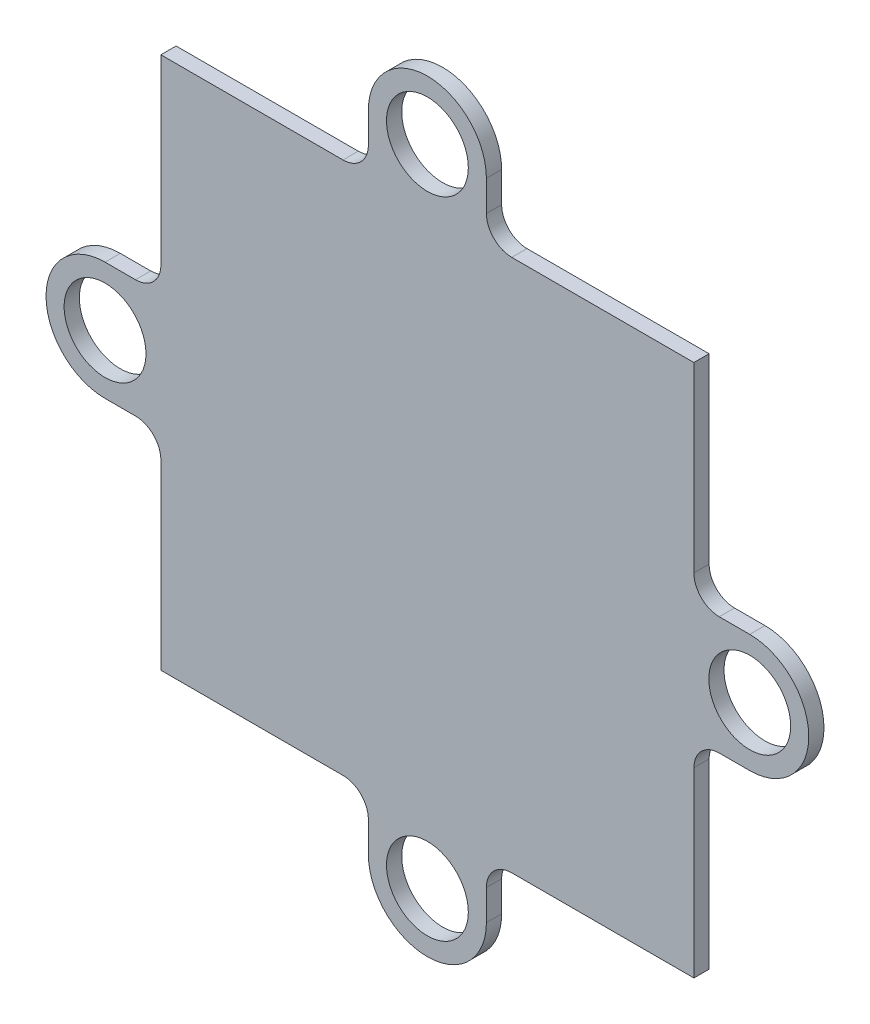
ISO-10303-21;
HEADER;
FILE_DESCRIPTION(('STEP AP214'),'2;1');
FILE_NAME('part.step','',(''),(''),'','','');
FILE_SCHEMA(('AUTOMOTIVE_DESIGN { 1 0 10303 214 1 1 1 1 }'));
ENDSEC;
DATA;
#1=APPLICATION_CONTEXT('core data for automotive mechanical design processes');
#2=APPLICATION_PROTOCOL_DEFINITION('international standard','automotive_design',2000,#1);
#3=PRODUCT_CONTEXT('',#1,'mechanical');
#4=PRODUCT('Part','Part','',(#3));
#5=PRODUCT_RELATED_PRODUCT_CATEGORY('part','',(#4));
#6=PRODUCT_DEFINITION_FORMATION('','',#4);
#7=PRODUCT_DEFINITION_CONTEXT('part definition',#1,'design');
#8=PRODUCT_DEFINITION('design','',#6,#7);
#9=PRODUCT_DEFINITION_SHAPE('','',#8);
#10=(LENGTH_UNIT() NAMED_UNIT(*) SI_UNIT(.MILLI.,.METRE.));
#11=(NAMED_UNIT(*) PLANE_ANGLE_UNIT() SI_UNIT($,.RADIAN.));
#12=(NAMED_UNIT(*) SI_UNIT($,.STERADIAN.) SOLID_ANGLE_UNIT());
#13=UNCERTAINTY_MEASURE_WITH_UNIT(LENGTH_MEASURE(1.E-05),#10,'distance_accuracy_value','');
#14=(GEOMETRIC_REPRESENTATION_CONTEXT(3) GLOBAL_UNCERTAINTY_ASSIGNED_CONTEXT((#13)) GLOBAL_UNIT_ASSIGNED_CONTEXT((#10,
#11,#12)) REPRESENTATION_CONTEXT('',''));
#15=CARTESIAN_POINT('',(0.,0.,0.));
#16=DIRECTION('',(0.,0.,1.));
#17=DIRECTION('',(1.,0.,0.));
#18=AXIS2_PLACEMENT_3D('',#15,#16,#17);
#19=CARTESIAN_POINT('',(0.,-4.64999999999974,1.2));
#20=DIRECTION('',(0.,1.,0.));
#21=DIRECTION('',(0.,0.,1.));
#22=AXIS2_PLACEMENT_3D('',#19,#20,#21);
#23=PLANE('',#22);
#24=DIRECTION('',(1.,0.,0.));
#25=VECTOR('',#24,1.);
#26=CARTESIAN_POINT('',(0.,-4.64999999999974,0.));
#27=LINE('',#26,#25);
#28=CARTESIAN_POINT('',(-25.4000000000001,-4.64999999999974,0.));
#29=VERTEX_POINT('',#28);
#30=CARTESIAN_POINT('',(-23.0000000000001,-4.64999999999974,0.));
#31=VERTEX_POINT('',#30);
#32=EDGE_CURVE('E282',#29,#31,#27,.T.);
#33=ORIENTED_EDGE('',*,*,#32,.T.);
#34=DIRECTION('',(0.,0.,-1.));
#35=VECTOR('',#34,1.);
#36=CARTESIAN_POINT('',(-23.0000000000001,-4.64999999999974,1.2));
#37=LINE('',#36,#35);
#38=CARTESIAN_POINT('',(-23.0000000000001,-4.64999999999974,1.2));
#39=VERTEX_POINT('',#38);
#40=EDGE_CURVE('E11',#39,#31,#37,.T.);
#41=ORIENTED_EDGE('',*,*,#40,.F.);
#42=DIRECTION('',(1.,0.,0.));
#43=VECTOR('',#42,1.);
#44=CARTESIAN_POINT('',(0.,-4.64999999999974,1.2));
#45=LINE('',#44,#43);
#46=CARTESIAN_POINT('',(-25.4000000000001,-4.64999999999974,1.2));
#47=VERTEX_POINT('',#46);
#48=EDGE_CURVE('E488',#47,#39,#45,.T.);
#49=ORIENTED_EDGE('',*,*,#48,.F.);
#50=DIRECTION('',(0.,0.,-1.));
#51=VECTOR('',#50,1.);
#52=CARTESIAN_POINT('',(-25.4000000000001,-4.64999999999974,1.2));
#53=LINE('',#52,#51);
#54=EDGE_CURVE('E262',#47,#29,#53,.T.);
#55=ORIENTED_EDGE('',*,*,#54,.T.);
#56=EDGE_LOOP('',(#33,#41,#49,#55));
#57=FACE_BOUND('',#56,.T.);
#58=ADVANCED_FACE('F45',(#57),#23,.F.);
#59=CARTESIAN_POINT('',(-23.0000000000001,-6.64999999999976,1.2));
#60=DIRECTION('',(0.,0.,-1.));
#61=DIRECTION('',(-1.,0.,0.));
#62=AXIS2_PLACEMENT_3D('',#59,#60,#61);
#63=CYLINDRICAL_SURFACE('',#62,2.00000000000001);
#64=CARTESIAN_POINT('',(-23.0000000000001,-6.64999999999976,0.));
#65=DIRECTION('',(0.,0.,1.));
#66=DIRECTION('',(1.,0.,0.));
#67=AXIS2_PLACEMENT_3D('',#64,#65,#66);
#68=CIRCLE('',#67,2.00000000000001);
#69=CARTESIAN_POINT('',(-21.0000000000001,-6.6499999999998,0.));
#70=VERTEX_POINT('',#69);
#71=EDGE_CURVE('E286',#31,#70,#68,.F.);
#72=ORIENTED_EDGE('',*,*,#71,.T.);
#73=DIRECTION('',(0.,0.,-1.));
#74=VECTOR('',#73,1.);
#75=CARTESIAN_POINT('',(-21.0000000000001,-6.6499999999998,1.2));
#76=LINE('',#75,#74);
#77=CARTESIAN_POINT('',(-21.0000000000001,-6.6499999999998,1.2));
#78=VERTEX_POINT('',#77);
#79=EDGE_CURVE('E55',#78,#70,#76,.T.);
#80=ORIENTED_EDGE('',*,*,#79,.F.);
#81=CARTESIAN_POINT('',(-23.0000000000001,-6.64999999999976,1.2));
#82=DIRECTION('',(0.,0.,1.));
#83=DIRECTION('',(1.,0.,0.));
#84=AXIS2_PLACEMENT_3D('',#81,#82,#83);
#85=CIRCLE('',#84,2.00000000000001);
#86=EDGE_CURVE('E162',#39,#78,#85,.F.);
#87=ORIENTED_EDGE('',*,*,#86,.F.);
#88=ORIENTED_EDGE('',*,*,#40,.T.);
#89=EDGE_LOOP('',(#72,#80,#87,#88));
#90=FACE_BOUND('',#89,.T.);
#91=ADVANCED_FACE('F468',(#90),#63,.F.);
#92=CARTESIAN_POINT('',(-21.0000000000001,-1.01544788837666E-13,1.2));
#93=DIRECTION('',(-1.,0.,0.));
#94=DIRECTION('',(0.,-1.,0.));
#95=AXIS2_PLACEMENT_3D('',#92,#93,#94);
#96=PLANE('',#95);
#97=DIRECTION('',(0.,1.,0.));
#98=VECTOR('',#97,1.);
#99=CARTESIAN_POINT('',(-21.0000000000001,-1.01544788837666E-13,0.));
#100=LINE('',#99,#98);
#101=CARTESIAN_POINT('',(-21.,-21.,0.));
#102=VERTEX_POINT('',#101);
#103=EDGE_CURVE('E290',#102,#70,#100,.T.);
#104=ORIENTED_EDGE('',*,*,#103,.F.);
#105=DIRECTION('',(0.,0.,-1.));
#106=VECTOR('',#105,1.);
#107=CARTESIAN_POINT('',(-21.,-21.,1.2));
#108=LINE('',#107,#106);
#109=CARTESIAN_POINT('',(-21.,-21.,1.2));
#110=VERTEX_POINT('',#109);
#111=EDGE_CURVE('E459',#110,#102,#108,.T.);
#112=ORIENTED_EDGE('',*,*,#111,.F.);
#113=DIRECTION('',(0.,1.,0.));
#114=VECTOR('',#113,1.);
#115=CARTESIAN_POINT('',(-21.0000000000001,-1.01544788837666E-13,1.2));
#116=LINE('',#115,#114);
#117=EDGE_CURVE('E467',#110,#78,#116,.T.);
#118=ORIENTED_EDGE('',*,*,#117,.T.);
#119=ORIENTED_EDGE('',*,*,#79,.T.);
#120=EDGE_LOOP('',(#104,#112,#118,#119));
#121=FACE_BOUND('',#120,.T.);
#122=ADVANCED_FACE('F465',(#121),#96,.T.);
#123=CARTESIAN_POINT('',(1.827806199078E-13,-20.9999999999998,1.2));
#124=DIRECTION('',(0.,1.,0.));
#125=DIRECTION('',(-1.,0.,0.));
#126=AXIS2_PLACEMENT_3D('',#123,#124,#125);
#127=PLANE('',#126);
#128=DIRECTION('',(1.,0.,0.));
#129=VECTOR('',#128,1.);
#130=CARTESIAN_POINT('',(1.827806199078E-13,-20.9999999999998,0.));
#131=LINE('',#130,#129);
#132=CARTESIAN_POINT('',(-6.65000000000012,-20.9999999999999,0.));
#133=VERTEX_POINT('',#132);
#134=EDGE_CURVE('E294',#102,#133,#131,.T.);
#135=ORIENTED_EDGE('',*,*,#134,.T.);
#136=DIRECTION('',(0.,0.,-1.));
#137=VECTOR('',#136,1.);
#138=CARTESIAN_POINT('',(-6.65000000000012,-20.9999999999999,1.2));
#139=LINE('',#138,#137);
#140=CARTESIAN_POINT('',(-6.65000000000012,-20.9999999999999,1.2));
#141=VERTEX_POINT('',#140);
#142=EDGE_CURVE('E456',#141,#133,#139,.T.);
#143=ORIENTED_EDGE('',*,*,#142,.F.);
#144=DIRECTION('',(1.,0.,0.));
#145=VECTOR('',#144,1.);
#146=CARTESIAN_POINT('',(1.827806199078E-13,-20.9999999999998,1.2));
#147=LINE('',#146,#145);
#148=EDGE_CURVE('E480',#110,#141,#147,.T.);
#149=ORIENTED_EDGE('',*,*,#148,.F.);
#150=ORIENTED_EDGE('',*,*,#111,.T.);
#151=EDGE_LOOP('',(#135,#143,#149,#150));
#152=FACE_BOUND('',#151,.T.);
#153=ADVANCED_FACE('F477',(#152),#127,.F.);
#154=CARTESIAN_POINT('',(-6.65000000000008,-22.9999999999999,1.2));
#155=DIRECTION('',(0.,0.,-1.));
#156=DIRECTION('',(-1.,0.,0.));
#157=AXIS2_PLACEMENT_3D('',#154,#155,#156);
#158=CYLINDRICAL_SURFACE('',#157,2.);
#159=CARTESIAN_POINT('',(-6.65000000000008,-22.9999999999999,0.));
#160=DIRECTION('',(0.,0.,1.));
#161=DIRECTION('',(1.,0.,0.));
#162=AXIS2_PLACEMENT_3D('',#159,#160,#161);
#163=CIRCLE('',#162,2.);
#164=CARTESIAN_POINT('',(-4.65000000000009,-22.9999999999999,0.));
#165=VERTEX_POINT('',#164);
#166=EDGE_CURVE('E298',#165,#133,#163,.T.);
#167=ORIENTED_EDGE('',*,*,#166,.F.);
#168=DIRECTION('',(0.,0.,-1.));
#169=VECTOR('',#168,1.);
#170=CARTESIAN_POINT('',(-4.65000000000009,-22.9999999999999,1.2));
#171=LINE('',#170,#169);
#172=CARTESIAN_POINT('',(-4.65000000000009,-22.9999999999999,1.2));
#173=VERTEX_POINT('',#172);
#174=EDGE_CURVE('E453',#173,#165,#171,.T.);
#175=ORIENTED_EDGE('',*,*,#174,.F.);
#176=CARTESIAN_POINT('',(-6.65000000000008,-22.9999999999999,1.2));
#177=DIRECTION('',(0.,0.,1.));
#178=DIRECTION('',(1.,0.,0.));
#179=AXIS2_PLACEMENT_3D('',#176,#177,#178);
#180=CIRCLE('',#179,2.);
#181=EDGE_CURVE('E483',#173,#141,#180,.T.);
#182=ORIENTED_EDGE('',*,*,#181,.T.);
#183=ORIENTED_EDGE('',*,*,#142,.T.);
#184=EDGE_LOOP('',(#167,#175,#182,#183));
#185=FACE_BOUND('',#184,.T.);
#186=ADVANCED_FACE('F841',(#185),#158,.F.);
#187=CARTESIAN_POINT('',(-4.65000000000009,0.,1.2));
#188=DIRECTION('',(-1.,0.,0.));
#189=DIRECTION('',(0.,0.,1.));
#190=AXIS2_PLACEMENT_3D('',#187,#188,#189);
#191=PLANE('',#190);
#192=DIRECTION('',(0.,1.,0.));
#193=VECTOR('',#192,1.);
#194=CARTESIAN_POINT('',(-4.65000000000009,0.,0.));
#195=LINE('',#194,#193);
#196=CARTESIAN_POINT('',(-4.65000000000009,-25.4,0.));
#197=VERTEX_POINT('',#196);
#198=EDGE_CURVE('E302',#197,#165,#195,.T.);
#199=ORIENTED_EDGE('',*,*,#198,.F.);
#200=DIRECTION('',(0.,0.,-1.));
#201=VECTOR('',#200,1.);
#202=CARTESIAN_POINT('',(-4.65000000000009,-25.4,1.2));
#203=LINE('',#202,#201);
#204=CARTESIAN_POINT('',(-4.65000000000009,-25.4,1.2));
#205=VERTEX_POINT('',#204);
#206=EDGE_CURVE('E450',#205,#197,#203,.T.);
#207=ORIENTED_EDGE('',*,*,#206,.F.);
#208=DIRECTION('',(0.,1.,0.));
#209=VECTOR('',#208,1.);
#210=CARTESIAN_POINT('',(-4.65000000000009,0.,1.2));
#211=LINE('',#210,#209);
#212=EDGE_CURVE('E494',#205,#173,#211,.T.);
#213=ORIENTED_EDGE('',*,*,#212,.T.);
#214=ORIENTED_EDGE('',*,*,#174,.T.);
#215=EDGE_LOOP('',(#199,#207,#213,#214));
#216=FACE_BOUND('',#215,.T.);
#217=ADVANCED_FACE('F832',(#216),#191,.T.);
#218=CARTESIAN_POINT('',(0.,-25.4,1.2));
#219=DIRECTION('',(0.,0.,-1.));
#220=DIRECTION('',(-1.,0.,0.));
#221=AXIS2_PLACEMENT_3D('',#218,#219,#220);
#222=CYLINDRICAL_SURFACE('',#221,4.65);
#223=CARTESIAN_POINT('',(0.,-25.4,0.));
#224=DIRECTION('',(0.,0.,1.));
#225=DIRECTION('',(1.,0.,0.));
#226=AXIS2_PLACEMENT_3D('',#223,#224,#225);
#227=CIRCLE('',#226,4.65);
#228=CARTESIAN_POINT('',(4.64999999999991,-25.4,0.));
#229=VERTEX_POINT('',#228);
#230=EDGE_CURVE('E306',#197,#229,#227,.T.);
#231=ORIENTED_EDGE('',*,*,#230,.T.);
#232=DIRECTION('',(0.,0.,-1.));
#233=VECTOR('',#232,1.);
#234=CARTESIAN_POINT('',(4.64999999999991,-25.4,1.2));
#235=LINE('',#234,#233);
#236=CARTESIAN_POINT('',(4.64999999999991,-25.4,1.2));
#237=VERTEX_POINT('',#236);
#238=EDGE_CURVE('E446',#237,#229,#235,.T.);
#239=ORIENTED_EDGE('',*,*,#238,.F.);
#240=CARTESIAN_POINT('',(0.,-25.4,1.2));
#241=DIRECTION('',(0.,0.,1.));
#242=DIRECTION('',(1.,0.,0.));
#243=AXIS2_PLACEMENT_3D('',#240,#241,#242);
#244=CIRCLE('',#243,4.65);
#245=EDGE_CURVE('E498',#205,#237,#244,.T.);
#246=ORIENTED_EDGE('',*,*,#245,.F.);
#247=ORIENTED_EDGE('',*,*,#206,.T.);
#248=EDGE_LOOP('',(#231,#239,#246,#247));
#249=FACE_BOUND('',#248,.T.);
#250=ADVANCED_FACE('F823',(#249),#222,.T.);
#251=CARTESIAN_POINT('',(4.64999999999991,0.,1.2));
#252=DIRECTION('',(-1.,0.,0.));
#253=DIRECTION('',(0.,0.,1.));
#254=AXIS2_PLACEMENT_3D('',#251,#252,#253);
#255=PLANE('',#254);
#256=DIRECTION('',(0.,1.,0.));
#257=VECTOR('',#256,1.);
#258=CARTESIAN_POINT('',(4.64999999999991,0.,0.));
#259=LINE('',#258,#257);
#260=CARTESIAN_POINT('',(4.64999999999991,-22.9999999999999,0.));
#261=VERTEX_POINT('',#260);
#262=EDGE_CURVE('E309',#229,#261,#259,.T.);
#263=ORIENTED_EDGE('',*,*,#262,.T.);
#264=DIRECTION('',(0.,0.,-1.));
#265=VECTOR('',#264,1.);
#266=CARTESIAN_POINT('',(4.64999999999991,-22.9999999999999,1.2));
#267=LINE('',#266,#265);
#268=CARTESIAN_POINT('',(4.64999999999991,-22.9999999999999,1.2));
#269=VERTEX_POINT('',#268);
#270=EDGE_CURVE('E442',#269,#261,#267,.T.);
#271=ORIENTED_EDGE('',*,*,#270,.F.);
#272=DIRECTION('',(0.,1.,0.));
#273=VECTOR('',#272,1.);
#274=CARTESIAN_POINT('',(4.64999999999991,0.,1.2));
#275=LINE('',#274,#273);
#276=EDGE_CURVE('E501',#237,#269,#275,.T.);
#277=ORIENTED_EDGE('',*,*,#276,.F.);
#278=ORIENTED_EDGE('',*,*,#238,.T.);
#279=EDGE_LOOP('',(#263,#271,#277,#278));
#280=FACE_BOUND('',#279,.T.);
#281=ADVANCED_FACE('F814',(#280),#255,.F.);
#282=CARTESIAN_POINT('',(6.6499999999999,-22.9999999999999,1.2));
#283=DIRECTION('',(0.,0.,-1.));
#284=DIRECTION('',(-1.,0.,0.));
#285=AXIS2_PLACEMENT_3D('',#282,#283,#284);
#286=CYLINDRICAL_SURFACE('',#285,2.);
#287=CARTESIAN_POINT('',(6.6499999999999,-22.9999999999999,0.));
#288=DIRECTION('',(0.,0.,1.));
#289=DIRECTION('',(1.,0.,0.));
#290=AXIS2_PLACEMENT_3D('',#287,#288,#289);
#291=CIRCLE('',#290,2.);
#292=CARTESIAN_POINT('',(6.64999999999994,-20.9999999999999,0.));
#293=VERTEX_POINT('',#292);
#294=EDGE_CURVE('E312',#261,#293,#291,.F.);
#295=ORIENTED_EDGE('',*,*,#294,.T.);
#296=DIRECTION('',(0.,0.,-1.));
#297=VECTOR('',#296,1.);
#298=CARTESIAN_POINT('',(6.64999999999994,-20.9999999999999,1.2));
#299=LINE('',#298,#297);
#300=CARTESIAN_POINT('',(6.64999999999994,-20.9999999999999,1.2));
#301=VERTEX_POINT('',#300);
#302=EDGE_CURVE('E438',#301,#293,#299,.T.);
#303=ORIENTED_EDGE('',*,*,#302,.F.);
#304=CARTESIAN_POINT('',(6.6499999999999,-22.9999999999999,1.2));
#305=DIRECTION('',(0.,0.,1.));
#306=DIRECTION('',(1.,0.,0.));
#307=AXIS2_PLACEMENT_3D('',#304,#305,#306);
#308=CIRCLE('',#307,2.);
#309=EDGE_CURVE('E504',#269,#301,#308,.F.);
#310=ORIENTED_EDGE('',*,*,#309,.F.);
#311=ORIENTED_EDGE('',*,*,#270,.T.);
#312=EDGE_LOOP('',(#295,#303,#310,#311));
#313=FACE_BOUND('',#312,.T.);
#314=ADVANCED_FACE('F805',(#313),#286,.F.);
#315=CARTESIAN_POINT('',(0.,-20.9999999999999,1.2));
#316=DIRECTION('',(0.,1.,0.));
#317=DIRECTION('',(0.,0.,1.));
#318=AXIS2_PLACEMENT_3D('',#315,#316,#317);
#319=PLANE('',#318);
#320=DIRECTION('',(1.,0.,0.));
#321=VECTOR('',#320,1.);
#322=CARTESIAN_POINT('',(0.,-20.9999999999999,0.));
#323=LINE('',#322,#321);
#324=CARTESIAN_POINT('',(21.,-21.,0.));
#325=VERTEX_POINT('',#324);
#326=EDGE_CURVE('E315',#293,#325,#323,.T.);
#327=ORIENTED_EDGE('',*,*,#326,.T.);
#328=DIRECTION('',(0.,0.,-1.));
#329=VECTOR('',#328,1.);
#330=CARTESIAN_POINT('',(21.,-21.,1.2));
#331=LINE('',#330,#329);
#332=CARTESIAN_POINT('',(21.,-21.,1.2));
#333=VERTEX_POINT('',#332);
#334=EDGE_CURVE('E434',#333,#325,#331,.T.);
#335=ORIENTED_EDGE('',*,*,#334,.F.);
#336=DIRECTION('',(1.,0.,0.));
#337=VECTOR('',#336,1.);
#338=CARTESIAN_POINT('',(0.,-20.9999999999999,1.2));
#339=LINE('',#338,#337);
#340=EDGE_CURVE('E507',#301,#333,#339,.T.);
#341=ORIENTED_EDGE('',*,*,#340,.F.);
#342=ORIENTED_EDGE('',*,*,#302,.T.);
#343=EDGE_LOOP('',(#327,#335,#341,#342));
#344=FACE_BOUND('',#343,.T.);
#345=ADVANCED_FACE('F796',(#344),#319,.F.);
#346=CARTESIAN_POINT('',(21.,0.,1.2));
#347=DIRECTION('',(-1.,0.,0.));
#348=DIRECTION('',(0.,-1.,0.));
#349=AXIS2_PLACEMENT_3D('',#346,#347,#348);
#350=PLANE('',#349);
#351=DIRECTION('',(0.,1.,0.));
#352=VECTOR('',#351,1.);
#353=CARTESIAN_POINT('',(21.,0.,0.));
#354=LINE('',#353,#352);
#355=CARTESIAN_POINT('',(21.,-6.6500000000001,0.));
#356=VERTEX_POINT('',#355);
#357=EDGE_CURVE('E318',#325,#356,#354,.T.);
#358=ORIENTED_EDGE('',*,*,#357,.T.);
#359=DIRECTION('',(0.,0.,-1.));
#360=VECTOR('',#359,1.);
#361=CARTESIAN_POINT('',(21.,-6.6500000000001,1.2));
#362=LINE('',#361,#360);
#363=CARTESIAN_POINT('',(21.,-6.6500000000001,1.2));
#364=VERTEX_POINT('',#363);
#365=EDGE_CURVE('E431',#364,#356,#362,.T.);
#366=ORIENTED_EDGE('',*,*,#365,.F.);
#367=DIRECTION('',(0.,1.,0.));
#368=VECTOR('',#367,1.);
#369=CARTESIAN_POINT('',(21.,0.,1.2));
#370=LINE('',#369,#368);
#371=EDGE_CURVE('E510',#333,#364,#370,.T.);
#372=ORIENTED_EDGE('',*,*,#371,.F.);
#373=ORIENTED_EDGE('',*,*,#334,.T.);
#374=EDGE_LOOP('',(#358,#366,#372,#373));
#375=FACE_BOUND('',#374,.T.);
#376=ADVANCED_FACE('F787',(#375),#350,.F.);
#377=CARTESIAN_POINT('',(23.,-6.65000000000009,1.2));
#378=DIRECTION('',(0.,0.,-1.));
#379=DIRECTION('',(-1.,0.,0.));
#380=AXIS2_PLACEMENT_3D('',#377,#378,#379);
#381=CYLINDRICAL_SURFACE('',#380,2.);
#382=CARTESIAN_POINT('',(23.,-6.65000000000009,0.));
#383=DIRECTION('',(0.,0.,1.));
#384=DIRECTION('',(1.,0.,0.));
#385=AXIS2_PLACEMENT_3D('',#382,#383,#384);
#386=CIRCLE('',#385,2.);
#387=CARTESIAN_POINT('',(23.,-4.6500000000001,0.));
#388=VERTEX_POINT('',#387);
#389=EDGE_CURVE('E322',#388,#356,#386,.T.);
#390=ORIENTED_EDGE('',*,*,#389,.F.);
#391=DIRECTION('',(0.,0.,-1.));
#392=VECTOR('',#391,1.);
#393=CARTESIAN_POINT('',(23.,-4.6500000000001,1.2));
#394=LINE('',#393,#392);
#395=CARTESIAN_POINT('',(23.,-4.6500000000001,1.2));
#396=VERTEX_POINT('',#395);
#397=EDGE_CURVE('E428',#396,#388,#394,.T.);
#398=ORIENTED_EDGE('',*,*,#397,.F.);
#399=CARTESIAN_POINT('',(23.,-6.65000000000009,1.2));
#400=DIRECTION('',(0.,0.,1.));
#401=DIRECTION('',(1.,0.,0.));
#402=AXIS2_PLACEMENT_3D('',#399,#400,#401);
#403=CIRCLE('',#402,2.);
#404=EDGE_CURVE('E513',#396,#364,#403,.T.);
#405=ORIENTED_EDGE('',*,*,#404,.T.);
#406=ORIENTED_EDGE('',*,*,#365,.T.);
#407=EDGE_LOOP('',(#390,#398,#405,#406));
#408=FACE_BOUND('',#407,.T.);
#409=ADVANCED_FACE('F778',(#408),#381,.F.);
#410=CARTESIAN_POINT('',(0.,-4.6500000000001,1.2));
#411=DIRECTION('',(0.,-1.,0.));
#412=DIRECTION('',(0.,0.,-1.));
#413=AXIS2_PLACEMENT_3D('',#410,#411,#412);
#414=PLANE('',#413);
#415=DIRECTION('',(-1.,0.,0.));
#416=VECTOR('',#415,1.);
#417=CARTESIAN_POINT('',(0.,-4.6500000000001,0.));
#418=LINE('',#417,#416);
#419=CARTESIAN_POINT('',(25.4000000000001,-4.6500000000001,0.));
#420=VERTEX_POINT('',#419);
#421=EDGE_CURVE('E326',#420,#388,#418,.T.);
#422=ORIENTED_EDGE('',*,*,#421,.F.);
#423=DIRECTION('',(0.,0.,-1.));
#424=VECTOR('',#423,1.);
#425=CARTESIAN_POINT('',(25.4000000000001,-4.6500000000001,1.2));
#426=LINE('',#425,#424);
#427=CARTESIAN_POINT('',(25.4000000000001,-4.6500000000001,1.2));
#428=VERTEX_POINT('',#427);
#429=EDGE_CURVE('E425',#428,#420,#426,.T.);
#430=ORIENTED_EDGE('',*,*,#429,.F.);
#431=DIRECTION('',(-1.,0.,0.));
#432=VECTOR('',#431,1.);
#433=CARTESIAN_POINT('',(0.,-4.6500000000001,1.2));
#434=LINE('',#433,#432);
#435=EDGE_CURVE('E517',#428,#396,#434,.T.);
#436=ORIENTED_EDGE('',*,*,#435,.T.);
#437=ORIENTED_EDGE('',*,*,#397,.T.);
#438=EDGE_LOOP('',(#422,#430,#436,#437));
#439=FACE_BOUND('',#438,.T.);
#440=ADVANCED_FACE('F769',(#439),#414,.T.);
#441=CARTESIAN_POINT('',(25.4000000000001,0.,1.2));
#442=DIRECTION('',(0.,0.,-1.));
#443=DIRECTION('',(-1.,0.,0.));
#444=AXIS2_PLACEMENT_3D('',#441,#442,#443);
#445=CYLINDRICAL_SURFACE('',#444,4.65);
#446=CARTESIAN_POINT('',(25.4000000000001,0.,0.));
#447=DIRECTION('',(0.,0.,1.));
#448=DIRECTION('',(1.,0.,0.));
#449=AXIS2_PLACEMENT_3D('',#446,#447,#448);
#450=CIRCLE('',#449,4.65);
#451=CARTESIAN_POINT('',(25.4000000000001,4.6499999999999,0.));
#452=VERTEX_POINT('',#451);
#453=EDGE_CURVE('E330',#420,#452,#450,.T.);
#454=ORIENTED_EDGE('',*,*,#453,.T.);
#455=DIRECTION('',(0.,0.,-1.));
#456=VECTOR('',#455,1.);
#457=CARTESIAN_POINT('',(25.4000000000001,4.6499999999999,1.2));
#458=LINE('',#457,#456);
#459=CARTESIAN_POINT('',(25.4000000000001,4.6499999999999,1.2));
#460=VERTEX_POINT('',#459);
#461=EDGE_CURVE('E421',#460,#452,#458,.T.);
#462=ORIENTED_EDGE('',*,*,#461,.F.);
#463=CARTESIAN_POINT('',(25.4000000000001,0.,1.2));
#464=DIRECTION('',(0.,0.,1.));
#465=DIRECTION('',(1.,0.,0.));
#466=AXIS2_PLACEMENT_3D('',#463,#464,#465);
#467=CIRCLE('',#466,4.65);
#468=EDGE_CURVE('E521',#428,#460,#467,.T.);
#469=ORIENTED_EDGE('',*,*,#468,.F.);
#470=ORIENTED_EDGE('',*,*,#429,.T.);
#471=EDGE_LOOP('',(#454,#462,#469,#470));
#472=FACE_BOUND('',#471,.T.);
#473=ADVANCED_FACE('F760',(#472),#445,.T.);
#474=CARTESIAN_POINT('',(0.,4.6499999999999,1.2));
#475=DIRECTION('',(0.,-1.,0.));
#476=DIRECTION('',(0.,0.,-1.));
#477=AXIS2_PLACEMENT_3D('',#474,#475,#476);
#478=PLANE('',#477);
#479=DIRECTION('',(-1.,0.,0.));
#480=VECTOR('',#479,1.);
#481=CARTESIAN_POINT('',(0.,4.6499999999999,0.));
#482=LINE('',#481,#480);
#483=CARTESIAN_POINT('',(23.,4.6499999999999,0.));
#484=VERTEX_POINT('',#483);
#485=EDGE_CURVE('E333',#452,#484,#482,.T.);
#486=ORIENTED_EDGE('',*,*,#485,.T.);
#487=DIRECTION('',(0.,0.,-1.));
#488=VECTOR('',#487,1.);
#489=CARTESIAN_POINT('',(23.,4.6499999999999,1.2));
#490=LINE('',#489,#488);
#491=CARTESIAN_POINT('',(23.,4.6499999999999,1.2));
#492=VERTEX_POINT('',#491);
#493=EDGE_CURVE('E417',#492,#484,#490,.T.);
#494=ORIENTED_EDGE('',*,*,#493,.F.);
#495=DIRECTION('',(-1.,0.,0.));
#496=VECTOR('',#495,1.);
#497=CARTESIAN_POINT('',(0.,4.6499999999999,1.2));
#498=LINE('',#497,#496);
#499=EDGE_CURVE('E524',#460,#492,#498,.T.);
#500=ORIENTED_EDGE('',*,*,#499,.F.);
#501=ORIENTED_EDGE('',*,*,#461,.T.);
#502=EDGE_LOOP('',(#486,#494,#500,#501));
#503=FACE_BOUND('',#502,.T.);
#504=ADVANCED_FACE('F751',(#503),#478,.F.);
#505=CARTESIAN_POINT('',(23.,6.64999999999991,1.2));
#506=DIRECTION('',(0.,0.,-1.));
#507=DIRECTION('',(-1.,0.,0.));
#508=AXIS2_PLACEMENT_3D('',#505,#506,#507);
#509=CYLINDRICAL_SURFACE('',#508,2.00000000000001);
#510=CARTESIAN_POINT('',(23.,6.64999999999991,0.));
#511=DIRECTION('',(0.,0.,1.));
#512=DIRECTION('',(1.,0.,0.));
#513=AXIS2_PLACEMENT_3D('',#510,#511,#512);
#514=CIRCLE('',#513,2.00000000000001);
#515=CARTESIAN_POINT('',(21.,6.64999999999993,0.));
#516=VERTEX_POINT('',#515);
#517=EDGE_CURVE('E336',#484,#516,#514,.F.);
#518=ORIENTED_EDGE('',*,*,#517,.T.);
#519=DIRECTION('',(0.,0.,-1.));
#520=VECTOR('',#519,1.);
#521=CARTESIAN_POINT('',(21.,6.64999999999993,1.2));
#522=LINE('',#521,#520);
#523=CARTESIAN_POINT('',(21.,6.64999999999993,1.2));
#524=VERTEX_POINT('',#523);
#525=EDGE_CURVE('E413',#524,#516,#522,.T.);
#526=ORIENTED_EDGE('',*,*,#525,.F.);
#527=CARTESIAN_POINT('',(23.,6.64999999999991,1.2));
#528=DIRECTION('',(0.,0.,1.));
#529=DIRECTION('',(1.,0.,0.));
#530=AXIS2_PLACEMENT_3D('',#527,#528,#529);
#531=CIRCLE('',#530,2.00000000000001);
#532=EDGE_CURVE('E527',#492,#524,#531,.F.);
#533=ORIENTED_EDGE('',*,*,#532,.F.);
#534=ORIENTED_EDGE('',*,*,#493,.T.);
#535=EDGE_LOOP('',(#518,#526,#533,#534));
#536=FACE_BOUND('',#535,.T.);
#537=ADVANCED_FACE('F742',(#536),#509,.F.);
#538=CARTESIAN_POINT('',(21.,0.,1.2));
#539=DIRECTION('',(-1.,0.,0.));
#540=DIRECTION('',(0.,0.,1.));
#541=AXIS2_PLACEMENT_3D('',#538,#539,#540);
#542=PLANE('',#541);
#543=DIRECTION('',(0.,1.,0.));
#544=VECTOR('',#543,1.);
#545=CARTESIAN_POINT('',(21.,0.,0.));
#546=LINE('',#545,#544);
#547=CARTESIAN_POINT('',(21.,21.,0.));
#548=VERTEX_POINT('',#547);
#549=EDGE_CURVE('E339',#516,#548,#546,.T.);
#550=ORIENTED_EDGE('',*,*,#549,.T.);
#551=DIRECTION('',(0.,0.,-1.));
#552=VECTOR('',#551,1.);
#553=CARTESIAN_POINT('',(21.,21.,1.2));
#554=LINE('',#553,#552);
#555=CARTESIAN_POINT('',(21.,21.,1.2));
#556=VERTEX_POINT('',#555);
#557=EDGE_CURVE('E410',#556,#548,#554,.T.);
#558=ORIENTED_EDGE('',*,*,#557,.F.);
#559=DIRECTION('',(0.,1.,0.));
#560=VECTOR('',#559,1.);
#561=CARTESIAN_POINT('',(21.,0.,1.2));
#562=LINE('',#561,#560);
#563=EDGE_CURVE('E530',#524,#556,#562,.T.);
#564=ORIENTED_EDGE('',*,*,#563,.F.);
#565=ORIENTED_EDGE('',*,*,#525,.T.);
#566=EDGE_LOOP('',(#550,#558,#564,#565));
#567=FACE_BOUND('',#566,.T.);
#568=ADVANCED_FACE('F733',(#567),#542,.F.);
#569=CARTESIAN_POINT('',(0.,21.,1.2));
#570=DIRECTION('',(0.,1.,0.));
#571=DIRECTION('',(0.,0.,1.));
#572=AXIS2_PLACEMENT_3D('',#569,#570,#571);
#573=PLANE('',#572);
#574=DIRECTION('',(1.,0.,0.));
#575=VECTOR('',#574,1.);
#576=CARTESIAN_POINT('',(0.,21.,0.));
#577=LINE('',#576,#575);
#578=CARTESIAN_POINT('',(6.65000000000001,21.,0.));
#579=VERTEX_POINT('',#578);
#580=EDGE_CURVE('E343',#579,#548,#577,.T.);
#581=ORIENTED_EDGE('',*,*,#580,.F.);
#582=DIRECTION('',(0.,0.,-1.));
#583=VECTOR('',#582,1.);
#584=CARTESIAN_POINT('',(6.65000000000001,21.,1.2));
#585=LINE('',#584,#583);
#586=CARTESIAN_POINT('',(6.65000000000001,21.,1.2));
#587=VERTEX_POINT('',#586);
#588=EDGE_CURVE('E407',#587,#579,#585,.T.);
#589=ORIENTED_EDGE('',*,*,#588,.F.);
#590=DIRECTION('',(1.,0.,0.));
#591=VECTOR('',#590,1.);
#592=CARTESIAN_POINT('',(0.,21.,1.2));
#593=LINE('',#592,#591);
#594=EDGE_CURVE('E533',#587,#556,#593,.T.);
#595=ORIENTED_EDGE('',*,*,#594,.T.);
#596=ORIENTED_EDGE('',*,*,#557,.T.);
#597=EDGE_LOOP('',(#581,#589,#595,#596));
#598=FACE_BOUND('',#597,.T.);
#599=ADVANCED_FACE('F724',(#598),#573,.T.);
#600=CARTESIAN_POINT('',(6.65000000000001,23.,1.2));
#601=DIRECTION('',(0.,0.,-1.));
#602=DIRECTION('',(-1.,0.,0.));
#603=AXIS2_PLACEMENT_3D('',#600,#601,#602);
#604=CYLINDRICAL_SURFACE('',#603,2.);
#605=CARTESIAN_POINT('',(6.65000000000001,23.,0.));
#606=DIRECTION('',(0.,0.,1.));
#607=DIRECTION('',(1.,0.,0.));
#608=AXIS2_PLACEMENT_3D('',#605,#606,#607);
#609=CIRCLE('',#608,2.);
#610=CARTESIAN_POINT('',(4.65,23.,0.));
#611=VERTEX_POINT('',#610);
#612=EDGE_CURVE('E347',#611,#579,#609,.T.);
#613=ORIENTED_EDGE('',*,*,#612,.F.);
#614=DIRECTION('',(0.,0.,-1.));
#615=VECTOR('',#614,1.);
#616=CARTESIAN_POINT('',(4.65,23.,1.2));
#617=LINE('',#616,#615);
#618=CARTESIAN_POINT('',(4.65,23.,1.2));
#619=VERTEX_POINT('',#618);
#620=EDGE_CURVE('E404',#619,#611,#617,.T.);
#621=ORIENTED_EDGE('',*,*,#620,.F.);
#622=CARTESIAN_POINT('',(6.65000000000001,23.,1.2));
#623=DIRECTION('',(0.,0.,1.));
#624=DIRECTION('',(1.,0.,0.));
#625=AXIS2_PLACEMENT_3D('',#622,#623,#624);
#626=CIRCLE('',#625,2.);
#627=EDGE_CURVE('E537',#619,#587,#626,.T.);
#628=ORIENTED_EDGE('',*,*,#627,.T.);
#629=ORIENTED_EDGE('',*,*,#588,.T.);
#630=EDGE_LOOP('',(#613,#621,#628,#629));
#631=FACE_BOUND('',#630,.T.);
#632=ADVANCED_FACE('F715',(#631),#604,.F.);
#633=CARTESIAN_POINT('',(4.65,0.,1.2));
#634=DIRECTION('',(1.,0.,0.));
#635=DIRECTION('',(0.,0.,-1.));
#636=AXIS2_PLACEMENT_3D('',#633,#634,#635);
#637=PLANE('',#636);
#638=DIRECTION('',(0.,-1.,0.));
#639=VECTOR('',#638,1.);
#640=CARTESIAN_POINT('',(4.65,0.,0.));
#641=LINE('',#640,#639);
#642=CARTESIAN_POINT('',(4.65,25.4000000000001,0.));
#643=VERTEX_POINT('',#642);
#644=EDGE_CURVE('E351',#643,#611,#641,.T.);
#645=ORIENTED_EDGE('',*,*,#644,.F.);
#646=DIRECTION('',(0.,0.,-1.));
#647=VECTOR('',#646,1.);
#648=CARTESIAN_POINT('',(4.65,25.4000000000001,1.2));
#649=LINE('',#648,#647);
#650=CARTESIAN_POINT('',(4.65,25.4000000000001,1.2));
#651=VERTEX_POINT('',#650);
#652=EDGE_CURVE('E401',#651,#643,#649,.T.);
#653=ORIENTED_EDGE('',*,*,#652,.F.);
#654=DIRECTION('',(0.,-1.,0.));
#655=VECTOR('',#654,1.);
#656=CARTESIAN_POINT('',(4.65,0.,1.2));
#657=LINE('',#656,#655);
#658=EDGE_CURVE('E541',#651,#619,#657,.T.);
#659=ORIENTED_EDGE('',*,*,#658,.T.);
#660=ORIENTED_EDGE('',*,*,#620,.T.);
#661=EDGE_LOOP('',(#645,#653,#659,#660));
#662=FACE_BOUND('',#661,.T.);
#663=ADVANCED_FACE('F706',(#662),#637,.T.);
#664=CARTESIAN_POINT('',(0.,25.4000000000001,1.2));
#665=DIRECTION('',(0.,0.,-1.));
#666=DIRECTION('',(-1.,0.,0.));
#667=AXIS2_PLACEMENT_3D('',#664,#665,#666);
#668=CYLINDRICAL_SURFACE('',#667,4.65);
#669=CARTESIAN_POINT('',(0.,25.4000000000001,0.));
#670=DIRECTION('',(0.,0.,1.));
#671=DIRECTION('',(1.,0.,0.));
#672=AXIS2_PLACEMENT_3D('',#669,#670,#671);
#673=CIRCLE('',#672,4.65);
#674=CARTESIAN_POINT('',(-4.65,25.4000000000001,0.));
#675=VERTEX_POINT('',#674);
#676=EDGE_CURVE('E355',#643,#675,#673,.T.);
#677=ORIENTED_EDGE('',*,*,#676,.T.);
#678=DIRECTION('',(0.,0.,-1.));
#679=VECTOR('',#678,1.);
#680=CARTESIAN_POINT('',(-4.65,25.4000000000001,1.2));
#681=LINE('',#680,#679);
#682=CARTESIAN_POINT('',(-4.65,25.4000000000001,1.2));
#683=VERTEX_POINT('',#682);
#684=EDGE_CURVE('E397',#683,#675,#681,.T.);
#685=ORIENTED_EDGE('',*,*,#684,.F.);
#686=CARTESIAN_POINT('',(0.,25.4000000000001,1.2));
#687=DIRECTION('',(0.,0.,1.));
#688=DIRECTION('',(1.,0.,0.));
#689=AXIS2_PLACEMENT_3D('',#686,#687,#688);
#690=CIRCLE('',#689,4.65);
#691=EDGE_CURVE('E545',#651,#683,#690,.T.);
#692=ORIENTED_EDGE('',*,*,#691,.F.);
#693=ORIENTED_EDGE('',*,*,#652,.T.);
#694=EDGE_LOOP('',(#677,#685,#692,#693));
#695=FACE_BOUND('',#694,.T.);
#696=ADVANCED_FACE('F697',(#695),#668,.T.);
#697=CARTESIAN_POINT('',(-4.65,0.,1.2));
#698=DIRECTION('',(1.,0.,0.));
#699=DIRECTION('',(0.,0.,-1.));
#700=AXIS2_PLACEMENT_3D('',#697,#698,#699);
#701=PLANE('',#700);
#702=DIRECTION('',(0.,-1.,0.));
#703=VECTOR('',#702,1.);
#704=CARTESIAN_POINT('',(-4.65,0.,0.));
#705=LINE('',#704,#703);
#706=CARTESIAN_POINT('',(-4.65,23.,0.));
#707=VERTEX_POINT('',#706);
#708=EDGE_CURVE('E358',#675,#707,#705,.T.);
#709=ORIENTED_EDGE('',*,*,#708,.T.);
#710=DIRECTION('',(0.,0.,-1.));
#711=VECTOR('',#710,1.);
#712=CARTESIAN_POINT('',(-4.65,23.,1.2));
#713=LINE('',#712,#711);
#714=CARTESIAN_POINT('',(-4.65,23.,1.2));
#715=VERTEX_POINT('',#714);
#716=EDGE_CURVE('E393',#715,#707,#713,.T.);
#717=ORIENTED_EDGE('',*,*,#716,.F.);
#718=DIRECTION('',(0.,-1.,0.));
#719=VECTOR('',#718,1.);
#720=CARTESIAN_POINT('',(-4.65,0.,1.2));
#721=LINE('',#720,#719);
#722=EDGE_CURVE('E548',#683,#715,#721,.T.);
#723=ORIENTED_EDGE('',*,*,#722,.F.);
#724=ORIENTED_EDGE('',*,*,#684,.T.);
#725=EDGE_LOOP('',(#709,#717,#723,#724));
#726=FACE_BOUND('',#725,.T.);
#727=ADVANCED_FACE('F688',(#726),#701,.F.);
#728=CARTESIAN_POINT('',(-6.65,23.,1.2));
#729=DIRECTION('',(0.,0.,-1.));
#730=DIRECTION('',(-1.,0.,0.));
#731=AXIS2_PLACEMENT_3D('',#728,#729,#730);
#732=CYLINDRICAL_SURFACE('',#731,2.);
#733=CARTESIAN_POINT('',(-6.65,23.,0.));
#734=DIRECTION('',(0.,0.,1.));
#735=DIRECTION('',(1.,0.,0.));
#736=AXIS2_PLACEMENT_3D('',#733,#734,#735);
#737=CIRCLE('',#736,2.);
#738=CARTESIAN_POINT('',(-6.65,21.,0.));
#739=VERTEX_POINT('',#738);
#740=EDGE_CURVE('E361',#707,#739,#737,.F.);
#741=ORIENTED_EDGE('',*,*,#740,.T.);
#742=DIRECTION('',(0.,0.,-1.));
#743=VECTOR('',#742,1.);
#744=CARTESIAN_POINT('',(-6.65,21.,1.2));
#745=LINE('',#744,#743);
#746=CARTESIAN_POINT('',(-6.65,21.,1.2));
#747=VERTEX_POINT('',#746);
#748=EDGE_CURVE('E390',#747,#739,#745,.T.);
#749=ORIENTED_EDGE('',*,*,#748,.F.);
#750=CARTESIAN_POINT('',(-6.65,23.,1.2));
#751=DIRECTION('',(0.,0.,1.));
#752=DIRECTION('',(1.,0.,0.));
#753=AXIS2_PLACEMENT_3D('',#750,#751,#752);
#754=CIRCLE('',#753,2.);
#755=EDGE_CURVE('E551',#715,#747,#754,.F.);
#756=ORIENTED_EDGE('',*,*,#755,.F.);
#757=ORIENTED_EDGE('',*,*,#716,.T.);
#758=EDGE_LOOP('',(#741,#749,#756,#757));
#759=FACE_BOUND('',#758,.T.);
#760=ADVANCED_FACE('F679',(#759),#732,.F.);
#761=CARTESIAN_POINT('',(0.,21.,1.2));
#762=DIRECTION('',(0.,1.,0.));
#763=DIRECTION('',(0.,0.,1.));
#764=AXIS2_PLACEMENT_3D('',#761,#762,#763);
#765=PLANE('',#764);
#766=DIRECTION('',(1.,0.,0.));
#767=VECTOR('',#766,1.);
#768=CARTESIAN_POINT('',(0.,21.,0.));
#769=LINE('',#768,#767);
#770=CARTESIAN_POINT('',(-21.,21.,0.));
#771=VERTEX_POINT('',#770);
#772=EDGE_CURVE('E365',#771,#739,#769,.T.);
#773=ORIENTED_EDGE('',*,*,#772,.F.);
#774=DIRECTION('',(0.,0.,-1.));
#775=VECTOR('',#774,1.);
#776=CARTESIAN_POINT('',(-21.,21.,1.2));
#777=LINE('',#776,#775);
#778=CARTESIAN_POINT('',(-21.,21.,1.2));
#779=VERTEX_POINT('',#778);
#780=EDGE_CURVE('E387',#779,#771,#777,.T.);
#781=ORIENTED_EDGE('',*,*,#780,.F.);
#782=DIRECTION('',(1.,0.,0.));
#783=VECTOR('',#782,1.);
#784=CARTESIAN_POINT('',(0.,21.,1.2));
#785=LINE('',#784,#783);
#786=EDGE_CURVE('E554',#779,#747,#785,.T.);
#787=ORIENTED_EDGE('',*,*,#786,.T.);
#788=ORIENTED_EDGE('',*,*,#748,.T.);
#789=EDGE_LOOP('',(#773,#781,#787,#788));
#790=FACE_BOUND('',#789,.T.);
#791=ADVANCED_FACE('F670',(#790),#765,.T.);
#792=CARTESIAN_POINT('',(-20.9999999999999,-1.01544788837668E-13,1.2));
#793=DIRECTION('',(-1.,0.,0.));
#794=DIRECTION('',(0.,-1.,0.));
#795=AXIS2_PLACEMENT_3D('',#792,#793,#794);
#796=PLANE('',#795);
#797=DIRECTION('',(0.,1.,0.));
#798=VECTOR('',#797,1.);
#799=CARTESIAN_POINT('',(-20.9999999999999,-1.01544788837668E-13,0.));
#800=LINE('',#799,#798);
#801=CARTESIAN_POINT('',(-20.9999999999999,6.65000000000023,0.));
#802=VERTEX_POINT('',#801);
#803=EDGE_CURVE('E369',#802,#771,#800,.T.);
#804=ORIENTED_EDGE('',*,*,#803,.F.);
#805=DIRECTION('',(0.,0.,-1.));
#806=VECTOR('',#805,1.);
#807=CARTESIAN_POINT('',(-20.9999999999999,6.65000000000023,1.2));
#808=LINE('',#807,#806);
#809=CARTESIAN_POINT('',(-20.9999999999999,6.65000000000023,1.2));
#810=VERTEX_POINT('',#809);
#811=EDGE_CURVE('E248',#810,#802,#808,.T.);
#812=ORIENTED_EDGE('',*,*,#811,.F.);
#813=DIRECTION('',(0.,1.,0.));
#814=VECTOR('',#813,1.);
#815=CARTESIAN_POINT('',(-20.9999999999999,-1.01544788837668E-13,1.2));
#816=LINE('',#815,#814);
#817=EDGE_CURVE('E255',#810,#779,#816,.T.);
#818=ORIENTED_EDGE('',*,*,#817,.T.);
#819=ORIENTED_EDGE('',*,*,#780,.T.);
#820=EDGE_LOOP('',(#804,#812,#818,#819));
#821=FACE_BOUND('',#820,.T.);
#822=ADVANCED_FACE('F560',(#821),#796,.T.);
#823=CARTESIAN_POINT('',(-22.9999999999999,6.65000000000024,1.2));
#824=DIRECTION('',(0.,0.,-1.));
#825=DIRECTION('',(-1.,0.,0.));
#826=AXIS2_PLACEMENT_3D('',#823,#824,#825);
#827=CYLINDRICAL_SURFACE('',#826,1.99999999999999);
#828=CARTESIAN_POINT('',(-22.9999999999999,6.65000000000024,0.));
#829=DIRECTION('',(0.,0.,1.));
#830=DIRECTION('',(1.,0.,0.));
#831=AXIS2_PLACEMENT_3D('',#828,#829,#830);
#832=CIRCLE('',#831,1.99999999999999);
#833=CARTESIAN_POINT('',(-22.9999999999999,4.65000000000026,0.));
#834=VERTEX_POINT('',#833);
#835=EDGE_CURVE('E242',#834,#802,#832,.T.);
#836=ORIENTED_EDGE('',*,*,#835,.F.);
#837=DIRECTION('',(0.,0.,-1.));
#838=VECTOR('',#837,1.);
#839=CARTESIAN_POINT('',(-22.9999999999999,4.65000000000026,1.2));
#840=LINE('',#839,#838);
#841=CARTESIAN_POINT('',(-22.9999999999999,4.65000000000026,1.2));
#842=VERTEX_POINT('',#841);
#843=EDGE_CURVE('E237',#842,#834,#840,.T.);
#844=ORIENTED_EDGE('',*,*,#843,.F.);
#845=CARTESIAN_POINT('',(-22.9999999999999,6.65000000000024,1.2));
#846=DIRECTION('',(0.,0.,1.));
#847=DIRECTION('',(1.,0.,0.));
#848=AXIS2_PLACEMENT_3D('',#845,#846,#847);
#849=CIRCLE('',#848,1.99999999999999);
#850=EDGE_CURVE('E240',#842,#810,#849,.T.);
#851=ORIENTED_EDGE('',*,*,#850,.T.);
#852=ORIENTED_EDGE('',*,*,#811,.T.);
#853=EDGE_LOOP('',(#836,#844,#851,#852));
#854=FACE_BOUND('',#853,.T.);
#855=ADVANCED_FACE('F239',(#854),#827,.F.);
#856=CARTESIAN_POINT('',(0.,4.65000000000026,1.2));
#857=DIRECTION('',(0.,1.,0.));
#858=DIRECTION('',(0.,0.,1.));
#859=AXIS2_PLACEMENT_3D('',#856,#857,#858);
#860=PLANE('',#859);
#861=DIRECTION('',(1.,0.,0.));
#862=VECTOR('',#861,1.);
#863=CARTESIAN_POINT('',(0.,4.65000000000026,0.));
#864=LINE('',#863,#862);
#865=CARTESIAN_POINT('',(-25.4000000000001,4.65000000000026,0.));
#866=VERTEX_POINT('',#865);
#867=EDGE_CURVE('E375',#866,#834,#864,.T.);
#868=ORIENTED_EDGE('',*,*,#867,.F.);
#869=DIRECTION('',(0.,0.,-1.));
#870=VECTOR('',#869,1.);
#871=CARTESIAN_POINT('',(-25.4000000000001,4.65000000000026,1.2));
#872=LINE('',#871,#870);
#873=CARTESIAN_POINT('',(-25.4000000000001,4.65000000000026,1.2));
#874=VERTEX_POINT('',#873);
#875=EDGE_CURVE('E151',#874,#866,#872,.T.);
#876=ORIENTED_EDGE('',*,*,#875,.F.);
#877=DIRECTION('',(1.,0.,0.));
#878=VECTOR('',#877,1.);
#879=CARTESIAN_POINT('',(0.,4.65000000000026,1.2));
#880=LINE('',#879,#878);
#881=EDGE_CURVE('E252',#874,#842,#880,.T.);
#882=ORIENTED_EDGE('',*,*,#881,.T.);
#883=ORIENTED_EDGE('',*,*,#843,.T.);
#884=EDGE_LOOP('',(#868,#876,#882,#883));
#885=FACE_BOUND('',#884,.T.);
#886=ADVANCED_FACE('F258',(#885),#860,.T.);
#887=CARTESIAN_POINT('',(-25.4000000000001,2.63677968348475E-13,1.2));
#888=DIRECTION('',(0.,0.,-1.));
#889=DIRECTION('',(-1.,0.,0.));
#890=AXIS2_PLACEMENT_3D('',#887,#888,#889);
#891=CYLINDRICAL_SURFACE('',#890,3.225);
#892=CARTESIAN_POINT('',(-25.4000000000001,2.63677968348475E-13,1.2));
#893=DIRECTION('',(0.,0.,1.));
#894=DIRECTION('',(1.,0.,0.));
#895=AXIS2_PLACEMENT_3D('',#892,#893,#894);
#896=CIRCLE('',#895,3.225);
#897=CARTESIAN_POINT('',(-22.1750000000001,2.63677968348475E-13,1.2));
#898=VERTEX_POINT('',#897);
#899=EDGE_CURVE('E977',#898,#898,#896,.T.);
#900=ORIENTED_EDGE('',*,*,#899,.T.);
#901=EDGE_LOOP('',(#900));
#902=FACE_BOUND('',#901,.T.);
#903=CARTESIAN_POINT('',(-25.4000000000001,2.63677968348475E-13,0.));
#904=DIRECTION('',(0.,0.,1.));
#905=DIRECTION('',(1.,0.,0.));
#906=AXIS2_PLACEMENT_3D('',#903,#904,#905);
#907=CIRCLE('',#906,3.225);
#908=CARTESIAN_POINT('',(-22.1750000000001,2.63677968348475E-13,0.));
#909=VERTEX_POINT('',#908);
#910=EDGE_CURVE('E278',#909,#909,#907,.T.);
#911=ORIENTED_EDGE('',*,*,#910,.F.);
#912=EDGE_LOOP('',(#911));
#913=FACE_BOUND('',#912,.T.);
#914=ADVANCED_FACE('F585',(#902,#913),#891,.F.);
#915=CARTESIAN_POINT('',(0.,-25.4,1.2));
#916=DIRECTION('',(0.,0.,-1.));
#917=DIRECTION('',(-1.,0.,0.));
#918=AXIS2_PLACEMENT_3D('',#915,#916,#917);
#919=CYLINDRICAL_SURFACE('',#918,3.22500000000011);
#920=CARTESIAN_POINT('',(0.,-25.4,1.2));
#921=DIRECTION('',(0.,0.,1.));
#922=DIRECTION('',(1.,0.,0.));
#923=AXIS2_PLACEMENT_3D('',#920,#921,#922);
#924=CIRCLE('',#923,3.22500000000011);
#925=CARTESIAN_POINT('',(3.22500000000002,-25.4,1.2));
#926=VERTEX_POINT('',#925);
#927=EDGE_CURVE('E972',#926,#926,#924,.T.);
#928=ORIENTED_EDGE('',*,*,#927,.T.);
#929=EDGE_LOOP('',(#928));
#930=FACE_BOUND('',#929,.T.);
#931=CARTESIAN_POINT('',(0.,-25.4,0.));
#932=DIRECTION('',(0.,0.,1.));
#933=DIRECTION('',(1.,0.,0.));
#934=AXIS2_PLACEMENT_3D('',#931,#932,#933);
#935=CIRCLE('',#934,3.22500000000011);
#936=CARTESIAN_POINT('',(3.22500000000002,-25.4,0.));
#937=VERTEX_POINT('',#936);
#938=EDGE_CURVE('E274',#937,#937,#935,.T.);
#939=ORIENTED_EDGE('',*,*,#938,.F.);
#940=EDGE_LOOP('',(#939));
#941=FACE_BOUND('',#940,.T.);
#942=ADVANCED_FACE('F588',(#930,#941),#919,.F.);
#943=CARTESIAN_POINT('',(25.4000000000001,0.,1.2));
#944=DIRECTION('',(0.,0.,-1.));
#945=DIRECTION('',(-1.,0.,0.));
#946=AXIS2_PLACEMENT_3D('',#943,#944,#945);
#947=CYLINDRICAL_SURFACE('',#946,3.225);
#948=CARTESIAN_POINT('',(25.4000000000001,0.,1.2));
#949=DIRECTION('',(0.,0.,1.));
#950=DIRECTION('',(1.,0.,0.));
#951=AXIS2_PLACEMENT_3D('',#948,#949,#950);
#952=CIRCLE('',#951,3.225);
#953=CARTESIAN_POINT('',(28.6250000000001,0.,1.2));
#954=VERTEX_POINT('',#953);
#955=EDGE_CURVE('E599',#954,#954,#952,.T.);
#956=ORIENTED_EDGE('',*,*,#955,.T.);
#957=EDGE_LOOP('',(#956));
#958=FACE_BOUND('',#957,.T.);
#959=CARTESIAN_POINT('',(25.4000000000001,0.,0.));
#960=DIRECTION('',(0.,0.,1.));
#961=DIRECTION('',(1.,0.,0.));
#962=AXIS2_PLACEMENT_3D('',#959,#960,#961);
#963=CIRCLE('',#962,3.225);
#964=CARTESIAN_POINT('',(28.6250000000001,0.,0.));
#965=VERTEX_POINT('',#964);
#966=EDGE_CURVE('E270',#965,#965,#963,.T.);
#967=ORIENTED_EDGE('',*,*,#966,.F.);
#968=EDGE_LOOP('',(#967));
#969=FACE_BOUND('',#968,.T.);
#970=ADVANCED_FACE('F573',(#958,#969),#947,.F.);
#971=CARTESIAN_POINT('',(0.,25.4000000000001,1.2));
#972=DIRECTION('',(0.,0.,-1.));
#973=DIRECTION('',(-1.,0.,0.));
#974=AXIS2_PLACEMENT_3D('',#971,#972,#973);
#975=CYLINDRICAL_SURFACE('',#974,3.225);
#976=CARTESIAN_POINT('',(0.,25.4000000000001,1.2));
#977=DIRECTION('',(0.,0.,1.));
#978=DIRECTION('',(1.,0.,0.));
#979=AXIS2_PLACEMENT_3D('',#976,#977,#978);
#980=CIRCLE('',#979,3.225);
#981=CARTESIAN_POINT('',(3.225,25.4000000000001,1.2));
#982=VERTEX_POINT('',#981);
#983=EDGE_CURVE('E380',#982,#982,#980,.T.);
#984=ORIENTED_EDGE('',*,*,#983,.T.);
#985=EDGE_LOOP('',(#984));
#986=FACE_BOUND('',#985,.T.);
#987=CARTESIAN_POINT('',(0.,25.4000000000001,0.));
#988=DIRECTION('',(0.,0.,1.));
#989=DIRECTION('',(1.,0.,0.));
#990=AXIS2_PLACEMENT_3D('',#987,#988,#989);
#991=CIRCLE('',#990,3.225);
#992=CARTESIAN_POINT('',(3.225,25.4000000000001,0.));
#993=VERTEX_POINT('',#992);
#994=EDGE_CURVE('E266',#993,#993,#991,.T.);
#995=ORIENTED_EDGE('',*,*,#994,.F.);
#996=EDGE_LOOP('',(#995));
#997=FACE_BOUND('',#996,.T.);
#998=ADVANCED_FACE('F47',(#986,#997),#975,.F.);
#999=CARTESIAN_POINT('',(-25.4000000000001,2.63677968348475E-13,1.2));
#1000=DIRECTION('',(0.,0.,-1.));
#1001=DIRECTION('',(-1.,0.,0.));
#1002=AXIS2_PLACEMENT_3D('',#999,#1000,#1001);
#1003=CYLINDRICAL_SURFACE('',#1002,4.65);
#1004=CARTESIAN_POINT('',(-25.4000000000001,2.63677968348475E-13,0.));
#1005=DIRECTION('',(0.,0.,1.));
#1006=DIRECTION('',(1.,0.,0.));
#1007=AXIS2_PLACEMENT_3D('',#1004,#1005,#1006);
#1008=CIRCLE('',#1007,4.65);
#1009=EDGE_CURVE('E154',#866,#29,#1008,.T.);
#1010=ORIENTED_EDGE('',*,*,#1009,.T.);
#1011=ORIENTED_EDGE('',*,*,#54,.F.);
#1012=CARTESIAN_POINT('',(-25.4000000000001,2.63677968348475E-13,1.2));
#1013=DIRECTION('',(0.,0.,1.));
#1014=DIRECTION('',(1.,0.,0.));
#1015=AXIS2_PLACEMENT_3D('',#1012,#1013,#1014);
#1016=CIRCLE('',#1015,4.65);
#1017=EDGE_CURVE('E63',#874,#47,#1016,.T.);
#1018=ORIENTED_EDGE('',*,*,#1017,.F.);
#1019=ORIENTED_EDGE('',*,*,#875,.T.);
#1020=EDGE_LOOP('',(#1010,#1011,#1018,#1019));
#1021=FACE_BOUND('',#1020,.T.);
#1022=ADVANCED_FACE('F564',(#1021),#1003,.T.);
#1023=CARTESIAN_POINT('',(0.,0.,1.2));
#1024=DIRECTION('',(0.,0.,1.));
#1025=DIRECTION('',(1.,0.,0.));
#1026=AXIS2_PLACEMENT_3D('',#1023,#1024,#1025);
#1027=PLANE('',#1026);
#1028=ORIENTED_EDGE('',*,*,#983,.F.);
#1029=EDGE_LOOP('',(#1028));
#1030=FACE_BOUND('',#1029,.T.);
#1031=ORIENTED_EDGE('',*,*,#955,.F.);
#1032=EDGE_LOOP('',(#1031));
#1033=FACE_BOUND('',#1032,.T.);
#1034=ORIENTED_EDGE('',*,*,#927,.F.);
#1035=EDGE_LOOP('',(#1034));
#1036=FACE_BOUND('',#1035,.T.);
#1037=ORIENTED_EDGE('',*,*,#899,.F.);
#1038=EDGE_LOOP('',(#1037));
#1039=FACE_BOUND('',#1038,.T.);
#1040=ORIENTED_EDGE('',*,*,#48,.T.);
#1041=ORIENTED_EDGE('',*,*,#86,.T.);
#1042=ORIENTED_EDGE('',*,*,#117,.F.);
#1043=ORIENTED_EDGE('',*,*,#148,.T.);
#1044=ORIENTED_EDGE('',*,*,#181,.F.);
#1045=ORIENTED_EDGE('',*,*,#212,.F.);
#1046=ORIENTED_EDGE('',*,*,#245,.T.);
#1047=ORIENTED_EDGE('',*,*,#276,.T.);
#1048=ORIENTED_EDGE('',*,*,#309,.T.);
#1049=ORIENTED_EDGE('',*,*,#340,.T.);
#1050=ORIENTED_EDGE('',*,*,#371,.T.);
#1051=ORIENTED_EDGE('',*,*,#404,.F.);
#1052=ORIENTED_EDGE('',*,*,#435,.F.);
#1053=ORIENTED_EDGE('',*,*,#468,.T.);
#1054=ORIENTED_EDGE('',*,*,#499,.T.);
#1055=ORIENTED_EDGE('',*,*,#532,.T.);
#1056=ORIENTED_EDGE('',*,*,#563,.T.);
#1057=ORIENTED_EDGE('',*,*,#594,.F.);
#1058=ORIENTED_EDGE('',*,*,#627,.F.);
#1059=ORIENTED_EDGE('',*,*,#658,.F.);
#1060=ORIENTED_EDGE('',*,*,#691,.T.);
#1061=ORIENTED_EDGE('',*,*,#722,.T.);
#1062=ORIENTED_EDGE('',*,*,#755,.T.);
#1063=ORIENTED_EDGE('',*,*,#786,.F.);
#1064=ORIENTED_EDGE('',*,*,#817,.F.);
#1065=ORIENTED_EDGE('',*,*,#850,.F.);
#1066=ORIENTED_EDGE('',*,*,#881,.F.);
#1067=ORIENTED_EDGE('',*,*,#1017,.T.);
#1068=EDGE_LOOP('',(#1040,#1041,#1042,#1043,#1044,#1045,#1046,#1047,#1048,#1049,#1050,#1051,
#1052,#1053,#1054,#1055,#1056,#1057,#1058,#1059,#1060,#1061,#1062,#1063,#1064,#1065,#1066,#1067));
#1069=FACE_BOUND('',#1068,.T.);
#1070=ADVANCED_FACE('F251',(#1030,#1033,#1036,#1039,#1069),#1027,.T.);
#1071=CARTESIAN_POINT('',(0.,0.,0.));
#1072=DIRECTION('',(0.,0.,1.));
#1073=DIRECTION('',(1.,0.,0.));
#1074=AXIS2_PLACEMENT_3D('',#1071,#1072,#1073);
#1075=PLANE('',#1074);
#1076=ORIENTED_EDGE('',*,*,#994,.T.);
#1077=EDGE_LOOP('',(#1076));
#1078=FACE_BOUND('',#1077,.T.);
#1079=ORIENTED_EDGE('',*,*,#966,.T.);
#1080=EDGE_LOOP('',(#1079));
#1081=FACE_BOUND('',#1080,.T.);
#1082=ORIENTED_EDGE('',*,*,#938,.T.);
#1083=EDGE_LOOP('',(#1082));
#1084=FACE_BOUND('',#1083,.T.);
#1085=ORIENTED_EDGE('',*,*,#910,.T.);
#1086=EDGE_LOOP('',(#1085));
#1087=FACE_BOUND('',#1086,.T.);
#1088=ORIENTED_EDGE('',*,*,#32,.F.);
#1089=ORIENTED_EDGE('',*,*,#1009,.F.);
#1090=ORIENTED_EDGE('',*,*,#867,.T.);
#1091=ORIENTED_EDGE('',*,*,#835,.T.);
#1092=ORIENTED_EDGE('',*,*,#803,.T.);
#1093=ORIENTED_EDGE('',*,*,#772,.T.);
#1094=ORIENTED_EDGE('',*,*,#740,.F.);
#1095=ORIENTED_EDGE('',*,*,#708,.F.);
#1096=ORIENTED_EDGE('',*,*,#676,.F.);
#1097=ORIENTED_EDGE('',*,*,#644,.T.);
#1098=ORIENTED_EDGE('',*,*,#612,.T.);
#1099=ORIENTED_EDGE('',*,*,#580,.T.);
#1100=ORIENTED_EDGE('',*,*,#549,.F.);
#1101=ORIENTED_EDGE('',*,*,#517,.F.);
#1102=ORIENTED_EDGE('',*,*,#485,.F.);
#1103=ORIENTED_EDGE('',*,*,#453,.F.);
#1104=ORIENTED_EDGE('',*,*,#421,.T.);
#1105=ORIENTED_EDGE('',*,*,#389,.T.);
#1106=ORIENTED_EDGE('',*,*,#357,.F.);
#1107=ORIENTED_EDGE('',*,*,#326,.F.);
#1108=ORIENTED_EDGE('',*,*,#294,.F.);
#1109=ORIENTED_EDGE('',*,*,#262,.F.);
#1110=ORIENTED_EDGE('',*,*,#230,.F.);
#1111=ORIENTED_EDGE('',*,*,#198,.T.);
#1112=ORIENTED_EDGE('',*,*,#166,.T.);
#1113=ORIENTED_EDGE('',*,*,#134,.F.);
#1114=ORIENTED_EDGE('',*,*,#103,.T.);
#1115=ORIENTED_EDGE('',*,*,#71,.F.);
#1116=EDGE_LOOP('',(#1088,#1089,#1090,#1091,#1092,#1093,#1094,#1095,#1096,#1097,#1098,#1099,
#1100,#1101,#1102,#1103,#1104,#1105,#1106,#1107,#1108,#1109,#1110,#1111,#1112,#1113,#1114,#1115));
#1117=FACE_BOUND('',#1116,.T.);
#1118=ADVANCED_FACE('F473',(#1078,#1081,#1084,#1087,#1117),#1075,.F.);
#1119=CLOSED_SHELL('',(#58,#91,#122,#153,#186,#217,#250,#281,#314,#345,#376,#409,#440,#473,#504,
#537,#568,#599,#632,#663,#696,#727,#760,#791,#822,#855,#886,#914,#942,#970,#998,#1022,#1070,#1118));
#1120=MANIFOLD_SOLID_BREP('B2',#1119);
#1121=ADVANCED_BREP_SHAPE_REPRESENTATION('',(#18,#1120),#14);
#1122=SHAPE_DEFINITION_REPRESENTATION(#9,#1121);
ENDSEC;
END-ISO-10303-21;
